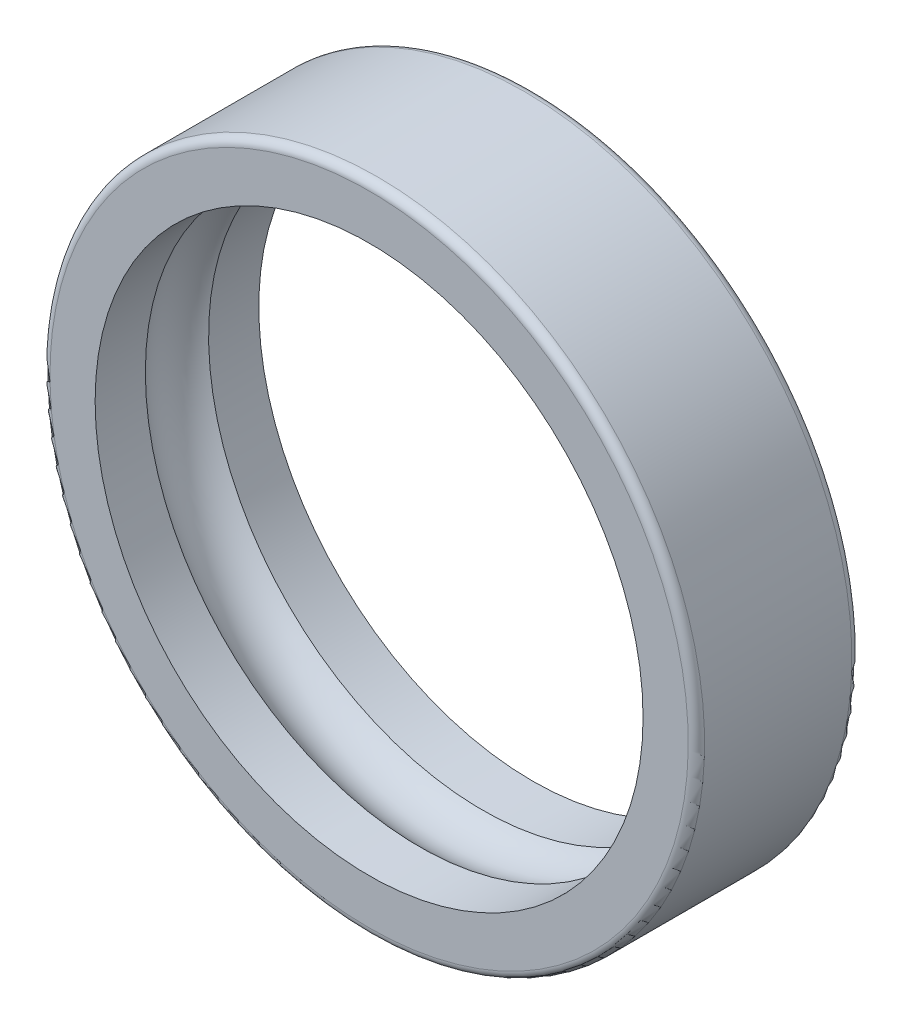
ISO-10303-21;
HEADER;
FILE_DESCRIPTION(('STEP AP214'),'2;1');
FILE_NAME('part.step','',(''),(''),'','','');
FILE_SCHEMA(('AUTOMOTIVE_DESIGN { 1 0 10303 214 1 1 1 1 }'));
ENDSEC;
DATA;
#1=APPLICATION_CONTEXT('core data for automotive mechanical design processes');
#2=APPLICATION_PROTOCOL_DEFINITION('international standard','automotive_design',2000,#1);
#3=PRODUCT_CONTEXT('',#1,'mechanical');
#4=PRODUCT('Part','Part','',(#3));
#5=PRODUCT_RELATED_PRODUCT_CATEGORY('part','',(#4));
#6=PRODUCT_DEFINITION_FORMATION('','',#4);
#7=PRODUCT_DEFINITION_CONTEXT('part definition',#1,'design');
#8=PRODUCT_DEFINITION('design','',#6,#7);
#9=PRODUCT_DEFINITION_SHAPE('','',#8);
#10=(LENGTH_UNIT() NAMED_UNIT(*) SI_UNIT(.MILLI.,.METRE.));
#11=(NAMED_UNIT(*) PLANE_ANGLE_UNIT() SI_UNIT($,.RADIAN.));
#12=(NAMED_UNIT(*) SI_UNIT($,.STERADIAN.) SOLID_ANGLE_UNIT());
#13=UNCERTAINTY_MEASURE_WITH_UNIT(LENGTH_MEASURE(1.E-05),#10,'distance_accuracy_value','');
#14=(GEOMETRIC_REPRESENTATION_CONTEXT(3) GLOBAL_UNCERTAINTY_ASSIGNED_CONTEXT((#13)) GLOBAL_UNIT_ASSIGNED_CONTEXT((#10,
#11,#12)) REPRESENTATION_CONTEXT('',''));
#15=CARTESIAN_POINT('',(0.,0.,0.));
#16=DIRECTION('',(0.,0.,1.));
#17=DIRECTION('',(1.,0.,0.));
#18=AXIS2_PLACEMENT_3D('',#15,#16,#17);
#19=CARTESIAN_POINT('',(0.,-6.66133814775094E-13,0.200000000000006));
#20=DIRECTION('',(0.,0.,-1.));
#21=DIRECTION('',(-1.,0.,0.));
#22=AXIS2_PLACEMENT_3D('',#19,#20,#21);
#23=TOROIDAL_SURFACE('',#22,7.8,0.2);
#24=CARTESIAN_POINT('',(0.,-6.66133814775094E-13,0.200000000000006));
#25=DIRECTION('',(0.,0.,-1.));
#26=DIRECTION('',(0.,-1.,0.));
#27=AXIS2_PLACEMENT_3D('',#24,#25,#26);
#28=CIRCLE('',#27,8.);
#29=CARTESIAN_POINT('',(-1.06435786730481E-13,-8.00000000000067,0.200000000000006));
#30=VERTEX_POINT('',#29);
#31=EDGE_CURVE('E11',#30,#30,#28,.T.);
#32=ORIENTED_EDGE('',*,*,#31,.T.);
#33=EDGE_LOOP('',(#32));
#34=FACE_BOUND('',#33,.T.);
#35=CARTESIAN_POINT('',(0.,-6.66133814775094E-13,0.));
#36=DIRECTION('',(0.,0.,1.));
#37=DIRECTION('',(0.,-1.,0.));
#38=AXIS2_PLACEMENT_3D('',#35,#36,#37);
#39=CIRCLE('',#38,7.8);
#40=CARTESIAN_POINT('',(-1.03865153905747E-13,-7.80000000000067,0.));
#41=VERTEX_POINT('',#40);
#42=EDGE_CURVE('E28',#41,#41,#39,.T.);
#43=ORIENTED_EDGE('',*,*,#42,.T.);
#44=EDGE_LOOP('',(#43));
#45=FACE_BOUND('',#44,.T.);
#46=ADVANCED_FACE('F17',(#34,#45),#23,.T.);
#47=CARTESIAN_POINT('',(0.,-6.66133814775094E-13,2.));
#48=DIRECTION('',(0.,0.,-1.));
#49=DIRECTION('',(0.,1.,0.));
#50=AXIS2_PLACEMENT_3D('',#47,#48,#49);
#51=CYLINDRICAL_SURFACE('',#50,8.);
#52=CARTESIAN_POINT('',(0.,-6.66133814775094E-13,3.8));
#53=DIRECTION('',(0.,0.,1.));
#54=DIRECTION('',(0.,-1.,0.));
#55=AXIS2_PLACEMENT_3D('',#52,#53,#54);
#56=CIRCLE('',#55,8.);
#57=CARTESIAN_POINT('',(-1.06435786730481E-13,-8.00000000000067,3.8));
#58=VERTEX_POINT('',#57);
#59=EDGE_CURVE('E73',#58,#58,#56,.T.);
#60=ORIENTED_EDGE('',*,*,#59,.F.);
#61=EDGE_LOOP('',(#60));
#62=FACE_BOUND('',#61,.T.);
#63=ORIENTED_EDGE('',*,*,#31,.F.);
#64=EDGE_LOOP('',(#63));
#65=FACE_BOUND('',#64,.T.);
#66=ADVANCED_FACE('F19',(#62,#65),#51,.T.);
#67=CARTESIAN_POINT('',(0.,7.34799999999936,0.));
#68=DIRECTION('',(0.,0.,-1.));
#69=DIRECTION('',(-1.,0.,0.));
#70=AXIS2_PLACEMENT_3D('',#67,#68,#69);
#71=PLANE('',#70);
#72=CARTESIAN_POINT('',(0.,-6.66133814775094E-13,0.));
#73=DIRECTION('',(0.,0.,-1.));
#74=DIRECTION('',(0.,1.,0.));
#75=AXIS2_PLACEMENT_3D('',#72,#73,#74);
#76=CIRCLE('',#75,6.696);
#77=CARTESIAN_POINT('',(0.,6.69599999999933,0.));
#78=VERTEX_POINT('',#77);
#79=EDGE_CURVE('E21',#78,#78,#76,.T.);
#80=ORIENTED_EDGE('',*,*,#79,.F.);
#81=EDGE_LOOP('',(#80));
#82=FACE_BOUND('',#81,.T.);
#83=ORIENTED_EDGE('',*,*,#42,.F.);
#84=EDGE_LOOP('',(#83));
#85=FACE_BOUND('',#84,.T.);
#86=ADVANCED_FACE('F88',(#82,#85),#71,.T.);
#87=CARTESIAN_POINT('',(0.,-6.66133814775094E-13,3.8));
#88=DIRECTION('',(0.,0.,-1.));
#89=DIRECTION('',(-1.,0.,0.));
#90=AXIS2_PLACEMENT_3D('',#87,#88,#89);
#91=TOROIDAL_SURFACE('',#90,7.8,0.2);
#92=CARTESIAN_POINT('',(0.,-6.66133814775094E-13,4.));
#93=DIRECTION('',(0.,0.,-1.));
#94=DIRECTION('',(0.,-1.,0.));
#95=AXIS2_PLACEMENT_3D('',#92,#93,#94);
#96=CIRCLE('',#95,7.8);
#97=CARTESIAN_POINT('',(-1.03865153905747E-13,-7.80000000000067,4.));
#98=VERTEX_POINT('',#97);
#99=EDGE_CURVE('E55',#98,#98,#96,.T.);
#100=ORIENTED_EDGE('',*,*,#99,.T.);
#101=EDGE_LOOP('',(#100));
#102=FACE_BOUND('',#101,.T.);
#103=ORIENTED_EDGE('',*,*,#59,.T.);
#104=EDGE_LOOP('',(#103));
#105=FACE_BOUND('',#104,.T.);
#106=ADVANCED_FACE('F84',(#102,#105),#91,.T.);
#107=CARTESIAN_POINT('',(0.,7.34799999999936,4.));
#108=DIRECTION('',(0.,0.,1.));
#109=DIRECTION('',(1.,0.,0.));
#110=AXIS2_PLACEMENT_3D('',#107,#108,#109);
#111=PLANE('',#110);
#112=CARTESIAN_POINT('',(0.,-6.66133814775094E-13,4.));
#113=DIRECTION('',(0.,0.,-1.));
#114=DIRECTION('',(1.,0.,0.));
#115=AXIS2_PLACEMENT_3D('',#112,#113,#114);
#116=CIRCLE('',#115,6.696);
#117=CARTESIAN_POINT('',(6.696,-7.53018625243928E-13,4.));
#118=VERTEX_POINT('',#117);
#119=EDGE_CURVE('E63',#118,#118,#116,.T.);
#120=ORIENTED_EDGE('',*,*,#119,.T.);
#121=EDGE_LOOP('',(#120));
#122=FACE_BOUND('',#121,.T.);
#123=ORIENTED_EDGE('',*,*,#99,.F.);
#124=EDGE_LOOP('',(#123));
#125=FACE_BOUND('',#124,.T.);
#126=ADVANCED_FACE('F64',(#122,#125),#111,.T.);
#127=CARTESIAN_POINT('',(0.,-6.66133814775094E-13,2.));
#128=DIRECTION('',(0.,0.,-1.));
#129=DIRECTION('',(0.984807753012206,-0.173648177666943,0.));
#130=AXIS2_PLACEMENT_3D('',#127,#128,#129);
#131=TOROIDAL_SURFACE('',#130,6.,1.04);
#132=CARTESIAN_POINT('',(0.,-6.66133814775094E-13,2.7727768112463));
#133=DIRECTION('',(0.,0.,-1.));
#134=DIRECTION('',(-1.,0.,0.));
#135=AXIS2_PLACEMENT_3D('',#132,#133,#134);
#136=CIRCLE('',#135,6.696);
#137=CARTESIAN_POINT('',(-6.696,-5.7924900430626E-13,2.7727768112463));
#138=VERTEX_POINT('',#137);
#139=EDGE_CURVE('E68',#138,#138,#136,.T.);
#140=ORIENTED_EDGE('',*,*,#139,.F.);
#141=EDGE_LOOP('',(#140));
#142=FACE_BOUND('',#141,.T.);
#143=CARTESIAN_POINT('',(0.,-6.66133814775094E-13,1.22722318875371));
#144=DIRECTION('',(0.,0.,-1.));
#145=DIRECTION('',(1.,0.,0.));
#146=AXIS2_PLACEMENT_3D('',#143,#144,#145);
#147=CIRCLE('',#146,6.696);
#148=CARTESIAN_POINT('',(6.696,-7.53018625243928E-13,1.22722318875371));
#149=VERTEX_POINT('',#148);
#150=EDGE_CURVE('E76',#149,#149,#147,.T.);
#151=ORIENTED_EDGE('',*,*,#150,.T.);
#152=EDGE_LOOP('',(#151));
#153=FACE_BOUND('',#152,.T.);
#154=ADVANCED_FACE('F102',(#142,#153),#131,.F.);
#155=CARTESIAN_POINT('',(0.,-6.66133814775094E-13,0.613611594376867));
#156=DIRECTION('',(0.,0.,-1.));
#157=DIRECTION('',(0.,1.,0.));
#158=AXIS2_PLACEMENT_3D('',#155,#156,#157);
#159=CYLINDRICAL_SURFACE('',#158,6.696);
#160=ORIENTED_EDGE('',*,*,#119,.F.);
#161=EDGE_LOOP('',(#160));
#162=FACE_BOUND('',#161,.T.);
#163=ORIENTED_EDGE('',*,*,#139,.T.);
#164=EDGE_LOOP('',(#163));
#165=FACE_BOUND('',#164,.T.);
#166=ADVANCED_FACE('F106',(#162,#165),#159,.F.);
#167=CARTESIAN_POINT('',(0.,-6.66133814775094E-13,0.613611594376867));
#168=DIRECTION('',(0.,0.,-1.));
#169=DIRECTION('',(0.,1.,0.));
#170=AXIS2_PLACEMENT_3D('',#167,#168,#169);
#171=CYLINDRICAL_SURFACE('',#170,6.696);
#172=ORIENTED_EDGE('',*,*,#150,.F.);
#173=EDGE_LOOP('',(#172));
#174=FACE_BOUND('',#173,.T.);
#175=ORIENTED_EDGE('',*,*,#79,.T.);
#176=EDGE_LOOP('',(#175));
#177=FACE_BOUND('',#176,.T.);
#178=ADVANCED_FACE('F104',(#174,#177),#171,.F.);
#179=CLOSED_SHELL('',(#46,#66,#86,#106,#126,#154,#166,#178));
#180=MANIFOLD_SOLID_BREP('B1',#179);
#181=ADVANCED_BREP_SHAPE_REPRESENTATION('',(#18,#180),#14);
#182=SHAPE_DEFINITION_REPRESENTATION(#9,#181);
ENDSEC;
END-ISO-10303-21;
